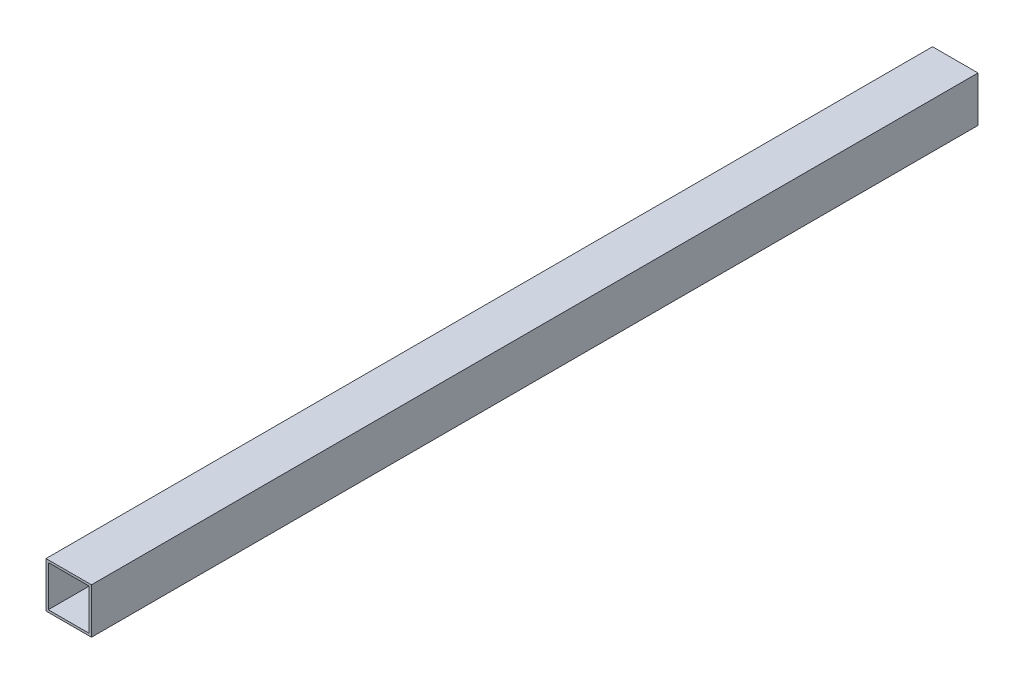
ISO-10303-21;
HEADER;
FILE_DESCRIPTION(('STEP AP214'),'2;1');
FILE_NAME('part.step','',(''),(''),'','','');
FILE_SCHEMA(('AUTOMOTIVE_DESIGN { 1 0 10303 214 1 1 1 1 }'));
ENDSEC;
DATA;
#1=APPLICATION_CONTEXT('core data for automotive mechanical design processes');
#2=APPLICATION_PROTOCOL_DEFINITION('international standard','automotive_design',2000,#1);
#3=PRODUCT_CONTEXT('',#1,'mechanical');
#4=PRODUCT('Part','Part','',(#3));
#5=PRODUCT_RELATED_PRODUCT_CATEGORY('part','',(#4));
#6=PRODUCT_DEFINITION_FORMATION('','',#4);
#7=PRODUCT_DEFINITION_CONTEXT('part definition',#1,'design');
#8=PRODUCT_DEFINITION('design','',#6,#7);
#9=PRODUCT_DEFINITION_SHAPE('','',#8);
#10=(LENGTH_UNIT() NAMED_UNIT(*) SI_UNIT(.MILLI.,.METRE.));
#11=(NAMED_UNIT(*) PLANE_ANGLE_UNIT() SI_UNIT($,.RADIAN.));
#12=(NAMED_UNIT(*) SI_UNIT($,.STERADIAN.) SOLID_ANGLE_UNIT());
#13=UNCERTAINTY_MEASURE_WITH_UNIT(LENGTH_MEASURE(1.E-05),#10,'distance_accuracy_value','');
#14=(GEOMETRIC_REPRESENTATION_CONTEXT(3) GLOBAL_UNCERTAINTY_ASSIGNED_CONTEXT((#13)) GLOBAL_UNIT_ASSIGNED_CONTEXT((#10,
#11,#12)) REPRESENTATION_CONTEXT('',''));
#15=CARTESIAN_POINT('',(0.,0.,0.));
#16=DIRECTION('',(0.,0.,1.));
#17=DIRECTION('',(1.,0.,0.));
#18=AXIS2_PLACEMENT_3D('',#15,#16,#17);
#19=CARTESIAN_POINT('',(0.,0.,390.));
#20=DIRECTION('',(0.,0.,1.));
#21=DIRECTION('',(1.,0.,0.));
#22=AXIS2_PLACEMENT_3D('',#19,#20,#21);
#23=PLANE('',#22);
#24=DIRECTION('',(0.,-1.,0.));
#25=VECTOR('',#24,1.);
#26=CARTESIAN_POINT('',(0.,0.,390.));
#27=LINE('',#26,#25);
#28=CARTESIAN_POINT('',(0.,0.,390.));
#29=VERTEX_POINT('',#28);
#30=CARTESIAN_POINT('',(0.,-20.,390.));
#31=VERTEX_POINT('',#30);
#32=EDGE_CURVE('E134',#29,#31,#27,.T.);
#33=ORIENTED_EDGE('',*,*,#32,.T.);
#34=DIRECTION('',(1.,0.,0.));
#35=VECTOR('',#34,1.);
#36=CARTESIAN_POINT('',(0.,-20.,390.));
#37=LINE('',#36,#35);
#38=CARTESIAN_POINT('',(20.,-20.,390.));
#39=VERTEX_POINT('',#38);
#40=EDGE_CURVE('E137',#31,#39,#37,.T.);
#41=ORIENTED_EDGE('',*,*,#40,.T.);
#42=DIRECTION('',(0.,1.,0.));
#43=VECTOR('',#42,1.);
#44=CARTESIAN_POINT('',(20.,0.,390.));
#45=LINE('',#44,#43);
#46=CARTESIAN_POINT('',(20.,0.,390.));
#47=VERTEX_POINT('',#46);
#48=EDGE_CURVE('E140',#39,#47,#45,.T.);
#49=ORIENTED_EDGE('',*,*,#48,.T.);
#50=DIRECTION('',(-1.,0.,0.));
#51=VECTOR('',#50,1.);
#52=CARTESIAN_POINT('',(0.,0.,390.));
#53=LINE('',#52,#51);
#54=EDGE_CURVE('E142',#47,#29,#53,.T.);
#55=ORIENTED_EDGE('',*,*,#54,.T.);
#56=EDGE_LOOP('',(#33,#41,#49,#55));
#57=FACE_BOUND('',#56,.T.);
#58=DIRECTION('',(-1.,0.,0.));
#59=VECTOR('',#58,1.);
#60=CARTESIAN_POINT('',(1.,-1.,390.));
#61=LINE('',#60,#59);
#62=CARTESIAN_POINT('',(19.,-1.,390.));
#63=VERTEX_POINT('',#62);
#64=CARTESIAN_POINT('',(1.,-1.,390.));
#65=VERTEX_POINT('',#64);
#66=EDGE_CURVE('E106',#63,#65,#61,.T.);
#67=ORIENTED_EDGE('',*,*,#66,.F.);
#68=DIRECTION('',(0.,1.,0.));
#69=VECTOR('',#68,1.);
#70=CARTESIAN_POINT('',(19.,-19.,390.));
#71=LINE('',#70,#69);
#72=CARTESIAN_POINT('',(19.,-19.,390.));
#73=VERTEX_POINT('',#72);
#74=EDGE_CURVE('E98',#73,#63,#71,.T.);
#75=ORIENTED_EDGE('',*,*,#74,.F.);
#76=DIRECTION('',(1.,0.,0.));
#77=VECTOR('',#76,1.);
#78=CARTESIAN_POINT('',(1.,-19.,390.));
#79=LINE('',#78,#77);
#80=CARTESIAN_POINT('',(1.,-19.,390.));
#81=VERTEX_POINT('',#80);
#82=EDGE_CURVE('E120',#81,#73,#79,.T.);
#83=ORIENTED_EDGE('',*,*,#82,.F.);
#84=DIRECTION('',(0.,-1.,0.));
#85=VECTOR('',#84,1.);
#86=CARTESIAN_POINT('',(1.,-19.,390.));
#87=LINE('',#86,#85);
#88=EDGE_CURVE('E118',#65,#81,#87,.T.);
#89=ORIENTED_EDGE('',*,*,#88,.F.);
#90=EDGE_LOOP('',(#67,#75,#83,#89));
#91=FACE_BOUND('',#90,.T.);
#92=ADVANCED_FACE('F33',(#57,#91),#23,.T.);
#93=CARTESIAN_POINT('',(0.,0.,0.));
#94=DIRECTION('',(0.,0.,1.));
#95=DIRECTION('',(1.,0.,0.));
#96=AXIS2_PLACEMENT_3D('',#93,#94,#95);
#97=PLANE('',#96);
#98=DIRECTION('',(0.,-1.,0.));
#99=VECTOR('',#98,1.);
#100=CARTESIAN_POINT('',(0.,0.,0.));
#101=LINE('',#100,#99);
#102=CARTESIAN_POINT('',(0.,0.,0.));
#103=VERTEX_POINT('',#102);
#104=CARTESIAN_POINT('',(0.,-20.,0.));
#105=VERTEX_POINT('',#104);
#106=EDGE_CURVE('E114',#103,#105,#101,.T.);
#107=ORIENTED_EDGE('',*,*,#106,.F.);
#108=DIRECTION('',(-1.,0.,0.));
#109=VECTOR('',#108,1.);
#110=CARTESIAN_POINT('',(0.,0.,0.));
#111=LINE('',#110,#109);
#112=CARTESIAN_POINT('',(20.,0.,0.));
#113=VERTEX_POINT('',#112);
#114=EDGE_CURVE('E138',#113,#103,#111,.T.);
#115=ORIENTED_EDGE('',*,*,#114,.F.);
#116=DIRECTION('',(0.,1.,0.));
#117=VECTOR('',#116,1.);
#118=CARTESIAN_POINT('',(20.,0.,0.));
#119=LINE('',#118,#117);
#120=CARTESIAN_POINT('',(20.,-20.,0.));
#121=VERTEX_POINT('',#120);
#122=EDGE_CURVE('E149',#121,#113,#119,.T.);
#123=ORIENTED_EDGE('',*,*,#122,.F.);
#124=DIRECTION('',(1.,0.,0.));
#125=VECTOR('',#124,1.);
#126=CARTESIAN_POINT('',(0.,-20.,0.));
#127=LINE('',#126,#125);
#128=EDGE_CURVE('E147',#105,#121,#127,.T.);
#129=ORIENTED_EDGE('',*,*,#128,.F.);
#130=EDGE_LOOP('',(#107,#115,#123,#129));
#131=FACE_BOUND('',#130,.T.);
#132=DIRECTION('',(0.,1.,0.));
#133=VECTOR('',#132,1.);
#134=CARTESIAN_POINT('',(19.,-19.,0.));
#135=LINE('',#134,#133);
#136=CARTESIAN_POINT('',(19.,-19.,0.));
#137=VERTEX_POINT('',#136);
#138=CARTESIAN_POINT('',(19.,-1.,0.));
#139=VERTEX_POINT('',#138);
#140=EDGE_CURVE('E56',#137,#139,#135,.T.);
#141=ORIENTED_EDGE('',*,*,#140,.T.);
#142=DIRECTION('',(-1.,0.,0.));
#143=VECTOR('',#142,1.);
#144=CARTESIAN_POINT('',(1.,-1.,0.));
#145=LINE('',#144,#143);
#146=CARTESIAN_POINT('',(1.,-1.,0.));
#147=VERTEX_POINT('',#146);
#148=EDGE_CURVE('E113',#139,#147,#145,.T.);
#149=ORIENTED_EDGE('',*,*,#148,.T.);
#150=DIRECTION('',(0.,-1.,0.));
#151=VECTOR('',#150,1.);
#152=CARTESIAN_POINT('',(1.,-19.,0.));
#153=LINE('',#152,#151);
#154=CARTESIAN_POINT('',(1.,-19.,0.));
#155=VERTEX_POINT('',#154);
#156=EDGE_CURVE('E126',#147,#155,#153,.T.);
#157=ORIENTED_EDGE('',*,*,#156,.T.);
#158=DIRECTION('',(1.,0.,0.));
#159=VECTOR('',#158,1.);
#160=CARTESIAN_POINT('',(1.,-19.,0.));
#161=LINE('',#160,#159);
#162=EDGE_CURVE('E107',#155,#137,#161,.T.);
#163=ORIENTED_EDGE('',*,*,#162,.T.);
#164=EDGE_LOOP('',(#141,#149,#157,#163));
#165=FACE_BOUND('',#164,.T.);
#166=ADVANCED_FACE('F167',(#131,#165),#97,.F.);
#167=CARTESIAN_POINT('',(0.,0.,390.));
#168=DIRECTION('',(1.,0.,0.));
#169=DIRECTION('',(0.,0.,-1.));
#170=AXIS2_PLACEMENT_3D('',#167,#168,#169);
#171=PLANE('',#170);
#172=ORIENTED_EDGE('',*,*,#106,.T.);
#173=DIRECTION('',(0.,0.,-1.));
#174=VECTOR('',#173,1.);
#175=CARTESIAN_POINT('',(0.,-20.,390.));
#176=LINE('',#175,#174);
#177=EDGE_CURVE('E11',#31,#105,#176,.T.);
#178=ORIENTED_EDGE('',*,*,#177,.F.);
#179=ORIENTED_EDGE('',*,*,#32,.F.);
#180=DIRECTION('',(0.,0.,-1.));
#181=VECTOR('',#180,1.);
#182=CARTESIAN_POINT('',(0.,0.,390.));
#183=LINE('',#182,#181);
#184=EDGE_CURVE('E144',#29,#103,#183,.T.);
#185=ORIENTED_EDGE('',*,*,#184,.T.);
#186=EDGE_LOOP('',(#172,#178,#179,#185));
#187=FACE_BOUND('',#186,.T.);
#188=ADVANCED_FACE('F35',(#187),#171,.F.);
#189=CARTESIAN_POINT('',(0.,-20.,390.));
#190=DIRECTION('',(0.,1.,0.));
#191=DIRECTION('',(0.,0.,1.));
#192=AXIS2_PLACEMENT_3D('',#189,#190,#191);
#193=PLANE('',#192);
#194=ORIENTED_EDGE('',*,*,#128,.T.);
#195=DIRECTION('',(0.,0.,-1.));
#196=VECTOR('',#195,1.);
#197=CARTESIAN_POINT('',(20.,-20.,390.));
#198=LINE('',#197,#196);
#199=EDGE_CURVE('E41',#39,#121,#198,.T.);
#200=ORIENTED_EDGE('',*,*,#199,.F.);
#201=ORIENTED_EDGE('',*,*,#40,.F.);
#202=ORIENTED_EDGE('',*,*,#177,.T.);
#203=EDGE_LOOP('',(#194,#200,#201,#202));
#204=FACE_BOUND('',#203,.T.);
#205=ADVANCED_FACE('F177',(#204),#193,.F.);
#206=CARTESIAN_POINT('',(20.,0.,390.));
#207=DIRECTION('',(-1.,0.,0.));
#208=DIRECTION('',(0.,-1.,0.));
#209=AXIS2_PLACEMENT_3D('',#206,#207,#208);
#210=PLANE('',#209);
#211=ORIENTED_EDGE('',*,*,#122,.T.);
#212=DIRECTION('',(0.,0.,-1.));
#213=VECTOR('',#212,1.);
#214=CARTESIAN_POINT('',(20.,0.,390.));
#215=LINE('',#214,#213);
#216=EDGE_CURVE('E154',#47,#113,#215,.T.);
#217=ORIENTED_EDGE('',*,*,#216,.F.);
#218=ORIENTED_EDGE('',*,*,#48,.F.);
#219=ORIENTED_EDGE('',*,*,#199,.T.);
#220=EDGE_LOOP('',(#211,#217,#218,#219));
#221=FACE_BOUND('',#220,.T.);
#222=ADVANCED_FACE('F161',(#221),#210,.F.);
#223=CARTESIAN_POINT('',(0.,0.,390.));
#224=DIRECTION('',(0.,-1.,0.));
#225=DIRECTION('',(0.,0.,-1.));
#226=AXIS2_PLACEMENT_3D('',#223,#224,#225);
#227=PLANE('',#226);
#228=ORIENTED_EDGE('',*,*,#114,.T.);
#229=ORIENTED_EDGE('',*,*,#184,.F.);
#230=ORIENTED_EDGE('',*,*,#54,.F.);
#231=ORIENTED_EDGE('',*,*,#216,.T.);
#232=EDGE_LOOP('',(#228,#229,#230,#231));
#233=FACE_BOUND('',#232,.T.);
#234=ADVANCED_FACE('F171',(#233),#227,.F.);
#235=CARTESIAN_POINT('',(19.,-19.,390.));
#236=DIRECTION('',(-1.,0.,0.));
#237=DIRECTION('',(0.,0.,1.));
#238=AXIS2_PLACEMENT_3D('',#235,#236,#237);
#239=PLANE('',#238);
#240=ORIENTED_EDGE('',*,*,#140,.F.);
#241=DIRECTION('',(0.,0.,-1.));
#242=VECTOR('',#241,1.);
#243=CARTESIAN_POINT('',(19.,-19.,390.));
#244=LINE('',#243,#242);
#245=EDGE_CURVE('E102',#73,#137,#244,.T.);
#246=ORIENTED_EDGE('',*,*,#245,.F.);
#247=ORIENTED_EDGE('',*,*,#74,.T.);
#248=DIRECTION('',(0.,0.,-1.));
#249=VECTOR('',#248,1.);
#250=CARTESIAN_POINT('',(19.,-1.,390.));
#251=LINE('',#250,#249);
#252=EDGE_CURVE('E101',#63,#139,#251,.T.);
#253=ORIENTED_EDGE('',*,*,#252,.T.);
#254=EDGE_LOOP('',(#240,#246,#247,#253));
#255=FACE_BOUND('',#254,.T.);
#256=ADVANCED_FACE('F100',(#255),#239,.T.);
#257=CARTESIAN_POINT('',(1.,-1.,390.));
#258=DIRECTION('',(0.,-1.,0.));
#259=DIRECTION('',(0.,0.,-1.));
#260=AXIS2_PLACEMENT_3D('',#257,#258,#259);
#261=PLANE('',#260);
#262=ORIENTED_EDGE('',*,*,#148,.F.);
#263=ORIENTED_EDGE('',*,*,#252,.F.);
#264=ORIENTED_EDGE('',*,*,#66,.T.);
#265=DIRECTION('',(0.,0.,-1.));
#266=VECTOR('',#265,1.);
#267=CARTESIAN_POINT('',(1.,-1.,390.));
#268=LINE('',#267,#266);
#269=EDGE_CURVE('E115',#65,#147,#268,.T.);
#270=ORIENTED_EDGE('',*,*,#269,.T.);
#271=EDGE_LOOP('',(#262,#263,#264,#270));
#272=FACE_BOUND('',#271,.T.);
#273=ADVANCED_FACE('F110',(#272),#261,.T.);
#274=CARTESIAN_POINT('',(1.,-19.,390.));
#275=DIRECTION('',(1.,0.,0.));
#276=DIRECTION('',(0.,0.,-1.));
#277=AXIS2_PLACEMENT_3D('',#274,#275,#276);
#278=PLANE('',#277);
#279=ORIENTED_EDGE('',*,*,#156,.F.);
#280=ORIENTED_EDGE('',*,*,#269,.F.);
#281=ORIENTED_EDGE('',*,*,#88,.T.);
#282=DIRECTION('',(0.,0.,-1.));
#283=VECTOR('',#282,1.);
#284=CARTESIAN_POINT('',(1.,-19.,390.));
#285=LINE('',#284,#283);
#286=EDGE_CURVE('E48',#81,#155,#285,.T.);
#287=ORIENTED_EDGE('',*,*,#286,.T.);
#288=EDGE_LOOP('',(#279,#280,#281,#287));
#289=FACE_BOUND('',#288,.T.);
#290=ADVANCED_FACE('F200',(#289),#278,.T.);
#291=CARTESIAN_POINT('',(1.,-19.,390.));
#292=DIRECTION('',(0.,1.,0.));
#293=DIRECTION('',(0.,0.,1.));
#294=AXIS2_PLACEMENT_3D('',#291,#292,#293);
#295=PLANE('',#294);
#296=ORIENTED_EDGE('',*,*,#162,.F.);
#297=ORIENTED_EDGE('',*,*,#286,.F.);
#298=ORIENTED_EDGE('',*,*,#82,.T.);
#299=ORIENTED_EDGE('',*,*,#245,.T.);
#300=EDGE_LOOP('',(#296,#297,#298,#299));
#301=FACE_BOUND('',#300,.T.);
#302=ADVANCED_FACE('F204',(#301),#295,.T.);
#303=CLOSED_SHELL('',(#92,#166,#188,#205,#222,#234,#256,#273,#290,#302));
#304=MANIFOLD_SOLID_BREP('B2',#303);
#305=ADVANCED_BREP_SHAPE_REPRESENTATION('',(#18,#304),#14);
#306=SHAPE_DEFINITION_REPRESENTATION(#9,#305);
ENDSEC;
END-ISO-10303-21;
